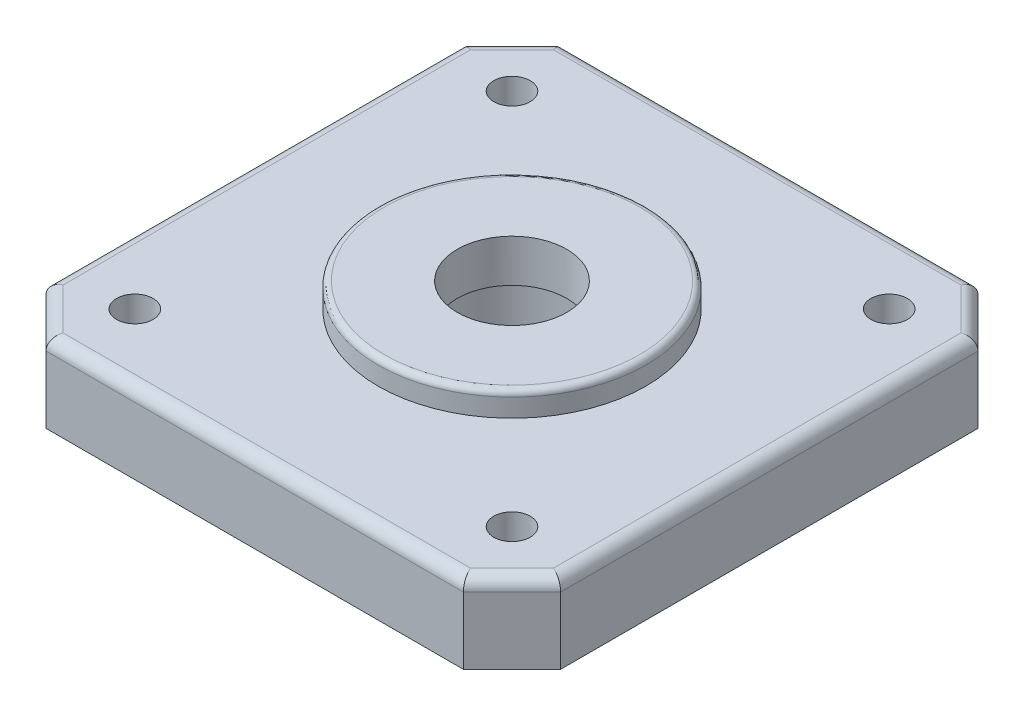
ISO-10303-21;
HEADER;
FILE_DESCRIPTION(('STEP AP214'),'2;1');
FILE_NAME('part.step','',(''),(''),'','','');
FILE_SCHEMA(('AUTOMOTIVE_DESIGN { 1 0 10303 214 1 1 1 1 }'));
ENDSEC;
DATA;
#1=APPLICATION_CONTEXT('core data for automotive mechanical design processes');
#2=APPLICATION_PROTOCOL_DEFINITION('international standard','automotive_design',2000,#1);
#3=PRODUCT_CONTEXT('',#1,'mechanical');
#4=PRODUCT('Part','Part','',(#3));
#5=PRODUCT_RELATED_PRODUCT_CATEGORY('part','',(#4));
#6=PRODUCT_DEFINITION_FORMATION('','',#4);
#7=PRODUCT_DEFINITION_CONTEXT('part definition',#1,'design');
#8=PRODUCT_DEFINITION('design','',#6,#7);
#9=PRODUCT_DEFINITION_SHAPE('','',#8);
#10=(LENGTH_UNIT() NAMED_UNIT(*) SI_UNIT(.MILLI.,.METRE.));
#11=(NAMED_UNIT(*) PLANE_ANGLE_UNIT() SI_UNIT($,.RADIAN.));
#12=(NAMED_UNIT(*) SI_UNIT($,.STERADIAN.) SOLID_ANGLE_UNIT());
#13=UNCERTAINTY_MEASURE_WITH_UNIT(LENGTH_MEASURE(1.E-05),#10,'distance_accuracy_value','');
#14=(GEOMETRIC_REPRESENTATION_CONTEXT(3) GLOBAL_UNCERTAINTY_ASSIGNED_CONTEXT((#13)) GLOBAL_UNIT_ASSIGNED_CONTEXT((#10,
#11,#12)) REPRESENTATION_CONTEXT('',''));
#15=CARTESIAN_POINT('',(0.,0.,0.));
#16=DIRECTION('',(0.,0.,1.));
#17=DIRECTION('',(1.,0.,0.));
#18=AXIS2_PLACEMENT_3D('',#15,#16,#17);
#19=CARTESIAN_POINT('',(0.,0.,0.));
#20=DIRECTION('',(0.,1.,0.));
#21=DIRECTION('',(0.,0.,1.));
#22=AXIS2_PLACEMENT_3D('',#19,#20,#21);
#23=CYLINDRICAL_SURFACE('',#22,4.5);
#24=CARTESIAN_POINT('',(0.,8.5,0.));
#25=DIRECTION('',(0.,1.,0.));
#26=DIRECTION('',(0.,0.,1.));
#27=AXIS2_PLACEMENT_3D('',#24,#25,#26);
#28=CIRCLE('',#27,4.5);
#29=CARTESIAN_POINT('',(0.,8.5,4.5));
#30=VERTEX_POINT('',#29);
#31=EDGE_CURVE('E186',#30,#30,#28,.T.);
#32=ORIENTED_EDGE('',*,*,#31,.T.);
#33=EDGE_LOOP('',(#32));
#34=FACE_BOUND('',#33,.T.);
#35=CARTESIAN_POINT('',(0.,5.,0.));
#36=DIRECTION('',(0.,-1.,0.));
#37=DIRECTION('',(0.,0.,-1.));
#38=AXIS2_PLACEMENT_3D('',#35,#36,#37);
#39=CIRCLE('',#38,4.5);
#40=CARTESIAN_POINT('',(0.,5.,-4.5));
#41=VERTEX_POINT('',#40);
#42=EDGE_CURVE('E183',#41,#41,#39,.F.);
#43=ORIENTED_EDGE('',*,*,#42,.F.);
#44=EDGE_LOOP('',(#43));
#45=FACE_BOUND('',#44,.T.);
#46=ADVANCED_FACE('F36',(#34,#45),#23,.F.);
#47=CARTESIAN_POINT('',(-17.15,6.5,-21.15));
#48=DIRECTION('',(0.,0.,1.));
#49=DIRECTION('',(1.,0.,0.));
#50=AXIS2_PLACEMENT_3D('',#47,#48,#49);
#51=PLANE('',#50);
#52=DIRECTION('',(0.,-1.,0.));
#53=VECTOR('',#52,1.);
#54=CARTESIAN_POINT('',(-17.15,6.5,-21.15));
#55=LINE('',#54,#53);
#56=CARTESIAN_POINT('',(-17.15,5.5,-21.15));
#57=VERTEX_POINT('',#56);
#58=CARTESIAN_POINT('',(-17.15,0.,-21.15));
#59=VERTEX_POINT('',#58);
#60=EDGE_CURVE('E124',#57,#59,#55,.T.);
#61=ORIENTED_EDGE('',*,*,#60,.F.);
#62=DIRECTION('',(-1.,0.,0.));
#63=VECTOR('',#62,1.);
#64=CARTESIAN_POINT('',(-17.15,5.5,-21.15));
#65=LINE('',#64,#63);
#66=CARTESIAN_POINT('',(17.15,5.5,-21.15));
#67=VERTEX_POINT('',#66);
#68=EDGE_CURVE('E218',#57,#67,#65,.F.);
#69=ORIENTED_EDGE('',*,*,#68,.T.);
#70=DIRECTION('',(0.,-1.,0.));
#71=VECTOR('',#70,1.);
#72=CARTESIAN_POINT('',(17.15,6.5,-21.15));
#73=LINE('',#72,#71);
#74=CARTESIAN_POINT('',(17.15,0.,-21.15));
#75=VERTEX_POINT('',#74);
#76=EDGE_CURVE('E146',#67,#75,#73,.T.);
#77=ORIENTED_EDGE('',*,*,#76,.T.);
#78=DIRECTION('',(-1.,0.,0.));
#79=VECTOR('',#78,1.);
#80=CARTESIAN_POINT('',(-17.15,0.,-21.15));
#81=LINE('',#80,#79);
#82=EDGE_CURVE('E139',#75,#59,#81,.T.);
#83=ORIENTED_EDGE('',*,*,#82,.T.);
#84=EDGE_LOOP('',(#61,#69,#77,#83));
#85=FACE_BOUND('',#84,.T.);
#86=ADVANCED_FACE('F144',(#85),#51,.F.);
#87=CARTESIAN_POINT('',(-21.15,6.5,-17.15));
#88=DIRECTION('',(0.707106781186548,0.,0.707106781186548));
#89=DIRECTION('',(0.707106781186548,0.,-0.707106781186548));
#90=AXIS2_PLACEMENT_3D('',#87,#88,#89);
#91=PLANE('',#90);
#92=DIRECTION('',(0.,-1.,0.));
#93=VECTOR('',#92,1.);
#94=CARTESIAN_POINT('',(-21.15,6.5,-17.15));
#95=LINE('',#94,#93);
#96=CARTESIAN_POINT('',(-21.15,5.5,-17.15));
#97=VERTEX_POINT('',#96);
#98=CARTESIAN_POINT('',(-21.15,0.,-17.15));
#99=VERTEX_POINT('',#98);
#100=EDGE_CURVE('E133',#97,#99,#95,.T.);
#101=ORIENTED_EDGE('',*,*,#100,.F.);
#102=DIRECTION('',(-0.707106781186548,0.,0.707106781186548));
#103=VECTOR('',#102,1.);
#104=CARTESIAN_POINT('',(-21.15,5.5,-17.15));
#105=LINE('',#104,#103);
#106=EDGE_CURVE('E51',#97,#57,#105,.F.);
#107=ORIENTED_EDGE('',*,*,#106,.T.);
#108=ORIENTED_EDGE('',*,*,#60,.T.);
#109=DIRECTION('',(-0.707106781186548,0.,0.707106781186548));
#110=VECTOR('',#109,1.);
#111=CARTESIAN_POINT('',(-21.15,0.,-17.15));
#112=LINE('',#111,#110);
#113=EDGE_CURVE('E127',#59,#99,#112,.T.);
#114=ORIENTED_EDGE('',*,*,#113,.T.);
#115=EDGE_LOOP('',(#101,#107,#108,#114));
#116=FACE_BOUND('',#115,.T.);
#117=ADVANCED_FACE('F126',(#116),#91,.F.);
#118=CARTESIAN_POINT('',(-21.15,6.5,-17.15));
#119=DIRECTION('',(1.,0.,0.));
#120=DIRECTION('',(0.,0.,-1.));
#121=AXIS2_PLACEMENT_3D('',#118,#119,#120);
#122=PLANE('',#121);
#123=DIRECTION('',(0.,-1.,0.));
#124=VECTOR('',#123,1.);
#125=CARTESIAN_POINT('',(-21.15,6.5,17.15));
#126=LINE('',#125,#124);
#127=CARTESIAN_POINT('',(-21.15,5.5,17.15));
#128=VERTEX_POINT('',#127);
#129=CARTESIAN_POINT('',(-21.15,0.,17.15));
#130=VERTEX_POINT('',#129);
#131=EDGE_CURVE('E180',#128,#130,#126,.T.);
#132=ORIENTED_EDGE('',*,*,#131,.F.);
#133=DIRECTION('',(0.,0.,1.));
#134=VECTOR('',#133,1.);
#135=CARTESIAN_POINT('',(-21.15,5.5,-17.15));
#136=LINE('',#135,#134);
#137=EDGE_CURVE('E59',#128,#97,#136,.F.);
#138=ORIENTED_EDGE('',*,*,#137,.T.);
#139=ORIENTED_EDGE('',*,*,#100,.T.);
#140=DIRECTION('',(0.,0.,1.));
#141=VECTOR('',#140,1.);
#142=CARTESIAN_POINT('',(-21.15,0.,-17.15));
#143=LINE('',#142,#141);
#144=EDGE_CURVE('E142',#99,#130,#143,.T.);
#145=ORIENTED_EDGE('',*,*,#144,.T.);
#146=EDGE_LOOP('',(#132,#138,#139,#145));
#147=FACE_BOUND('',#146,.T.);
#148=ADVANCED_FACE('F320',(#147),#122,.F.);
#149=CARTESIAN_POINT('',(-21.15,6.5,17.15));
#150=DIRECTION('',(0.707106781186548,0.,-0.707106781186548));
#151=DIRECTION('',(-0.707106781186548,0.,-0.707106781186548));
#152=AXIS2_PLACEMENT_3D('',#149,#150,#151);
#153=PLANE('',#152);
#154=DIRECTION('',(0.,-1.,0.));
#155=VECTOR('',#154,1.);
#156=CARTESIAN_POINT('',(-17.15,6.5,21.15));
#157=LINE('',#156,#155);
#158=CARTESIAN_POINT('',(-17.15,5.5,21.15));
#159=VERTEX_POINT('',#158);
#160=CARTESIAN_POINT('',(-17.15,0.,21.15));
#161=VERTEX_POINT('',#160);
#162=EDGE_CURVE('E178',#159,#161,#157,.T.);
#163=ORIENTED_EDGE('',*,*,#162,.F.);
#164=DIRECTION('',(0.707106781186548,0.,0.707106781186548));
#165=VECTOR('',#164,1.);
#166=CARTESIAN_POINT('',(-21.15,5.5,17.15));
#167=LINE('',#166,#165);
#168=EDGE_CURVE('E214',#159,#128,#167,.F.);
#169=ORIENTED_EDGE('',*,*,#168,.T.);
#170=ORIENTED_EDGE('',*,*,#131,.T.);
#171=DIRECTION('',(0.707106781186548,0.,0.707106781186548));
#172=VECTOR('',#171,1.);
#173=CARTESIAN_POINT('',(-21.15,0.,17.15));
#174=LINE('',#173,#172);
#175=EDGE_CURVE('E157',#130,#161,#174,.T.);
#176=ORIENTED_EDGE('',*,*,#175,.T.);
#177=EDGE_LOOP('',(#163,#169,#170,#176));
#178=FACE_BOUND('',#177,.T.);
#179=ADVANCED_FACE('F316',(#178),#153,.F.);
#180=CARTESIAN_POINT('',(-17.15,6.5,21.15));
#181=DIRECTION('',(0.,0.,-1.));
#182=DIRECTION('',(-1.,0.,0.));
#183=AXIS2_PLACEMENT_3D('',#180,#181,#182);
#184=PLANE('',#183);
#185=DIRECTION('',(0.,-1.,0.));
#186=VECTOR('',#185,1.);
#187=CARTESIAN_POINT('',(17.15,6.5,21.15));
#188=LINE('',#187,#186);
#189=CARTESIAN_POINT('',(17.15,5.5,21.15));
#190=VERTEX_POINT('',#189);
#191=CARTESIAN_POINT('',(17.15,0.,21.15));
#192=VERTEX_POINT('',#191);
#193=EDGE_CURVE('E176',#190,#192,#188,.T.);
#194=ORIENTED_EDGE('',*,*,#193,.F.);
#195=DIRECTION('',(1.,0.,0.));
#196=VECTOR('',#195,1.);
#197=CARTESIAN_POINT('',(-17.15,5.5,21.15));
#198=LINE('',#197,#196);
#199=EDGE_CURVE('E212',#190,#159,#198,.F.);
#200=ORIENTED_EDGE('',*,*,#199,.T.);
#201=ORIENTED_EDGE('',*,*,#162,.T.);
#202=DIRECTION('',(1.,0.,0.));
#203=VECTOR('',#202,1.);
#204=CARTESIAN_POINT('',(-17.15,0.,21.15));
#205=LINE('',#204,#203);
#206=EDGE_CURVE('E160',#161,#192,#205,.T.);
#207=ORIENTED_EDGE('',*,*,#206,.T.);
#208=EDGE_LOOP('',(#194,#200,#201,#207));
#209=FACE_BOUND('',#208,.T.);
#210=ADVANCED_FACE('F312',(#209),#184,.F.);
#211=CARTESIAN_POINT('',(17.15,6.5,21.15));
#212=DIRECTION('',(-0.707106781186548,0.,-0.707106781186548));
#213=DIRECTION('',(-0.707106781186548,0.,0.707106781186548));
#214=AXIS2_PLACEMENT_3D('',#211,#212,#213);
#215=PLANE('',#214);
#216=DIRECTION('',(0.,-1.,0.));
#217=VECTOR('',#216,1.);
#218=CARTESIAN_POINT('',(21.15,6.5,17.15));
#219=LINE('',#218,#217);
#220=CARTESIAN_POINT('',(21.15,5.5,17.15));
#221=VERTEX_POINT('',#220);
#222=CARTESIAN_POINT('',(21.15,0.,17.15));
#223=VERTEX_POINT('',#222);
#224=EDGE_CURVE('E174',#221,#223,#219,.T.);
#225=ORIENTED_EDGE('',*,*,#224,.F.);
#226=DIRECTION('',(0.707106781186548,0.,-0.707106781186548));
#227=VECTOR('',#226,1.);
#228=CARTESIAN_POINT('',(17.15,5.5,21.15));
#229=LINE('',#228,#227);
#230=EDGE_CURVE('E210',#221,#190,#229,.F.);
#231=ORIENTED_EDGE('',*,*,#230,.T.);
#232=ORIENTED_EDGE('',*,*,#193,.T.);
#233=DIRECTION('',(0.707106781186548,0.,-0.707106781186548));
#234=VECTOR('',#233,1.);
#235=CARTESIAN_POINT('',(17.15,0.,21.15));
#236=LINE('',#235,#234);
#237=EDGE_CURVE('E163',#192,#223,#236,.T.);
#238=ORIENTED_EDGE('',*,*,#237,.T.);
#239=EDGE_LOOP('',(#225,#231,#232,#238));
#240=FACE_BOUND('',#239,.T.);
#241=ADVANCED_FACE('F308',(#240),#215,.F.);
#242=CARTESIAN_POINT('',(21.15,6.5,-17.15));
#243=DIRECTION('',(-1.,0.,0.));
#244=DIRECTION('',(0.,0.,1.));
#245=AXIS2_PLACEMENT_3D('',#242,#243,#244);
#246=PLANE('',#245);
#247=DIRECTION('',(0.,-1.,0.));
#248=VECTOR('',#247,1.);
#249=CARTESIAN_POINT('',(21.15,6.5,-17.15));
#250=LINE('',#249,#248);
#251=CARTESIAN_POINT('',(21.15,5.5,-17.15));
#252=VERTEX_POINT('',#251);
#253=CARTESIAN_POINT('',(21.15,0.,-17.15));
#254=VERTEX_POINT('',#253);
#255=EDGE_CURVE('E172',#252,#254,#250,.T.);
#256=ORIENTED_EDGE('',*,*,#255,.F.);
#257=DIRECTION('',(0.,0.,-1.));
#258=VECTOR('',#257,1.);
#259=CARTESIAN_POINT('',(21.15,5.5,-17.15));
#260=LINE('',#259,#258);
#261=EDGE_CURVE('E208',#252,#221,#260,.F.);
#262=ORIENTED_EDGE('',*,*,#261,.T.);
#263=ORIENTED_EDGE('',*,*,#224,.T.);
#264=DIRECTION('',(0.,0.,-1.));
#265=VECTOR('',#264,1.);
#266=CARTESIAN_POINT('',(21.15,0.,-17.15));
#267=LINE('',#266,#265);
#268=EDGE_CURVE('E166',#223,#254,#267,.T.);
#269=ORIENTED_EDGE('',*,*,#268,.T.);
#270=EDGE_LOOP('',(#256,#262,#263,#269));
#271=FACE_BOUND('',#270,.T.);
#272=ADVANCED_FACE('F304',(#271),#246,.F.);
#273=CARTESIAN_POINT('',(17.15,6.5,-21.15));
#274=DIRECTION('',(-0.707106781186548,0.,0.707106781186548));
#275=DIRECTION('',(0.707106781186548,0.,0.707106781186548));
#276=AXIS2_PLACEMENT_3D('',#273,#274,#275);
#277=PLANE('',#276);
#278=ORIENTED_EDGE('',*,*,#76,.F.);
#279=DIRECTION('',(-0.707106781186548,0.,-0.707106781186548));
#280=VECTOR('',#279,1.);
#281=CARTESIAN_POINT('',(17.15,5.5,-21.15));
#282=LINE('',#281,#280);
#283=EDGE_CURVE('E205',#67,#252,#282,.F.);
#284=ORIENTED_EDGE('',*,*,#283,.T.);
#285=ORIENTED_EDGE('',*,*,#255,.T.);
#286=DIRECTION('',(-0.707106781186548,0.,-0.707106781186548));
#287=VECTOR('',#286,1.);
#288=CARTESIAN_POINT('',(17.15,0.,-21.15));
#289=LINE('',#288,#287);
#290=EDGE_CURVE('E169',#254,#75,#289,.T.);
#291=ORIENTED_EDGE('',*,*,#290,.T.);
#292=EDGE_LOOP('',(#278,#284,#285,#291));
#293=FACE_BOUND('',#292,.T.);
#294=ADVANCED_FACE('F297',(#293),#277,.F.);
#295=CARTESIAN_POINT('',(0.,6.5,0.));
#296=DIRECTION('',(0.,-1.,0.));
#297=DIRECTION('',(0.,0.,-1.));
#298=AXIS2_PLACEMENT_3D('',#295,#296,#297);
#299=PLANE('',#298);
#300=DIRECTION('',(0.,0.,-1.));
#301=VECTOR('',#300,1.);
#302=CARTESIAN_POINT('',(20.15,6.5,0.));
#303=LINE('',#302,#301);
#304=CARTESIAN_POINT('',(20.15,6.5,16.7357864376269));
#305=VERTEX_POINT('',#304);
#306=CARTESIAN_POINT('',(20.15,6.5,-16.7357864376269));
#307=VERTEX_POINT('',#306);
#308=EDGE_CURVE('E200',#305,#307,#303,.T.);
#309=ORIENTED_EDGE('',*,*,#308,.T.);
#310=DIRECTION('',(-0.707106781186548,0.,-0.707106781186548));
#311=VECTOR('',#310,1.);
#312=CARTESIAN_POINT('',(18.4428932188134,6.5,-18.4428932188134));
#313=LINE('',#312,#311);
#314=CARTESIAN_POINT('',(16.7357864376269,6.5,-20.15));
#315=VERTEX_POINT('',#314);
#316=EDGE_CURVE('E202',#307,#315,#313,.T.);
#317=ORIENTED_EDGE('',*,*,#316,.T.);
#318=DIRECTION('',(-1.,0.,0.));
#319=VECTOR('',#318,1.);
#320=CARTESIAN_POINT('',(0.,6.5,-20.15));
#321=LINE('',#320,#319);
#322=CARTESIAN_POINT('',(-16.7357864376269,6.5,-20.15));
#323=VERTEX_POINT('',#322);
#324=EDGE_CURVE('E188',#315,#323,#321,.T.);
#325=ORIENTED_EDGE('',*,*,#324,.T.);
#326=DIRECTION('',(-0.707106781186548,0.,0.707106781186548));
#327=VECTOR('',#326,1.);
#328=CARTESIAN_POINT('',(-18.4428932188135,6.5,-18.4428932188135));
#329=LINE('',#328,#327);
#330=CARTESIAN_POINT('',(-20.15,6.5,-16.7357864376269));
#331=VERTEX_POINT('',#330);
#332=EDGE_CURVE('E190',#323,#331,#329,.T.);
#333=ORIENTED_EDGE('',*,*,#332,.T.);
#334=DIRECTION('',(0.,0.,1.));
#335=VECTOR('',#334,1.);
#336=CARTESIAN_POINT('',(-20.15,6.5,0.));
#337=LINE('',#336,#335);
#338=CARTESIAN_POINT('',(-20.15,6.5,16.7357864376269));
#339=VERTEX_POINT('',#338);
#340=EDGE_CURVE('E192',#331,#339,#337,.T.);
#341=ORIENTED_EDGE('',*,*,#340,.T.);
#342=DIRECTION('',(0.707106781186548,0.,0.707106781186548));
#343=VECTOR('',#342,1.);
#344=CARTESIAN_POINT('',(-18.4428932188134,6.5,18.4428932188134));
#345=LINE('',#344,#343);
#346=CARTESIAN_POINT('',(-16.7357864376269,6.5,20.15));
#347=VERTEX_POINT('',#346);
#348=EDGE_CURVE('E194',#339,#347,#345,.T.);
#349=ORIENTED_EDGE('',*,*,#348,.T.);
#350=DIRECTION('',(1.,0.,0.));
#351=VECTOR('',#350,1.);
#352=CARTESIAN_POINT('',(0.,6.5,20.15));
#353=LINE('',#352,#351);
#354=CARTESIAN_POINT('',(16.7357864376269,6.5,20.15));
#355=VERTEX_POINT('',#354);
#356=EDGE_CURVE('E196',#347,#355,#353,.T.);
#357=ORIENTED_EDGE('',*,*,#356,.T.);
#358=DIRECTION('',(0.707106781186548,0.,-0.707106781186548));
#359=VECTOR('',#358,1.);
#360=CARTESIAN_POINT('',(18.4428932188134,6.5,18.4428932188134));
#361=LINE('',#360,#359);
#362=EDGE_CURVE('E198',#355,#305,#361,.T.);
#363=ORIENTED_EDGE('',*,*,#362,.T.);
#364=EDGE_LOOP('',(#309,#317,#325,#333,#341,#349,#357,#363));
#365=FACE_BOUND('',#364,.T.);
#366=CARTESIAN_POINT('',(15.5,6.5,-15.5));
#367=DIRECTION('',(0.,1.,0.));
#368=DIRECTION('',(0.,0.,1.));
#369=AXIS2_PLACEMENT_3D('',#366,#367,#368);
#370=CIRCLE('',#369,1.5);
#371=CARTESIAN_POINT('',(15.5,6.5,-14.));
#372=VERTEX_POINT('',#371);
#373=EDGE_CURVE('E387',#372,#372,#370,.T.);
#374=ORIENTED_EDGE('',*,*,#373,.F.);
#375=EDGE_LOOP('',(#374));
#376=FACE_BOUND('',#375,.T.);
#377=CARTESIAN_POINT('',(-15.5,6.5,15.5));
#378=DIRECTION('',(0.,1.,0.));
#379=DIRECTION('',(0.,0.,1.));
#380=AXIS2_PLACEMENT_3D('',#377,#378,#379);
#381=CIRCLE('',#380,1.5);
#382=CARTESIAN_POINT('',(-15.5,6.5,17.));
#383=VERTEX_POINT('',#382);
#384=EDGE_CURVE('E391',#383,#383,#381,.T.);
#385=ORIENTED_EDGE('',*,*,#384,.F.);
#386=EDGE_LOOP('',(#385));
#387=FACE_BOUND('',#386,.T.);
#388=CARTESIAN_POINT('',(15.5,6.5,15.5));
#389=DIRECTION('',(0.,1.,0.));
#390=DIRECTION('',(0.,0.,1.));
#391=AXIS2_PLACEMENT_3D('',#388,#389,#390);
#392=CIRCLE('',#391,1.5);
#393=CARTESIAN_POINT('',(15.5,6.5,17.));
#394=VERTEX_POINT('',#393);
#395=EDGE_CURVE('E395',#394,#394,#392,.T.);
#396=ORIENTED_EDGE('',*,*,#395,.F.);
#397=EDGE_LOOP('',(#396));
#398=FACE_BOUND('',#397,.T.);
#399=CARTESIAN_POINT('',(-15.5,6.5,-15.5));
#400=DIRECTION('',(0.,1.,0.));
#401=DIRECTION('',(0.,0.,1.));
#402=AXIS2_PLACEMENT_3D('',#399,#400,#401);
#403=CIRCLE('',#402,1.5);
#404=CARTESIAN_POINT('',(-15.5,6.5,-14.));
#405=VERTEX_POINT('',#404);
#406=EDGE_CURVE('E151',#405,#405,#403,.T.);
#407=ORIENTED_EDGE('',*,*,#406,.F.);
#408=EDGE_LOOP('',(#407));
#409=FACE_BOUND('',#408,.T.);
#410=CARTESIAN_POINT('',(0.,6.5,0.));
#411=DIRECTION('',(0.,1.,0.));
#412=DIRECTION('',(0.,0.,1.));
#413=AXIS2_PLACEMENT_3D('',#410,#411,#412);
#414=CIRCLE('',#413,11.);
#415=CARTESIAN_POINT('',(0.,6.5,11.));
#416=VERTEX_POINT('',#415);
#417=EDGE_CURVE('E132',#416,#416,#414,.T.);
#418=ORIENTED_EDGE('',*,*,#417,.F.);
#419=EDGE_LOOP('',(#418));
#420=FACE_BOUND('',#419,.T.);
#421=ADVANCED_FACE('F294',(#365,#376,#387,#398,#409,#420),#299,.F.);
#422=CARTESIAN_POINT('',(0.,0.,0.));
#423=DIRECTION('',(0.,-1.,0.));
#424=DIRECTION('',(0.,0.,-1.));
#425=AXIS2_PLACEMENT_3D('',#422,#423,#424);
#426=PLANE('',#425);
#427=CARTESIAN_POINT('',(0.,0.,0.));
#428=DIRECTION('',(0.,-1.,0.));
#429=DIRECTION('',(0.,0.,-1.));
#430=AXIS2_PLACEMENT_3D('',#427,#428,#429);
#431=CIRCLE('',#430,5.5);
#432=CARTESIAN_POINT('',(0.,0.,-5.5));
#433=VERTEX_POINT('',#432);
#434=EDGE_CURVE('E241',#433,#433,#431,.T.);
#435=ORIENTED_EDGE('',*,*,#434,.F.);
#436=EDGE_LOOP('',(#435));
#437=FACE_BOUND('',#436,.T.);
#438=CARTESIAN_POINT('',(15.5,0.,-15.5));
#439=DIRECTION('',(0.,1.,0.));
#440=DIRECTION('',(0.,0.,1.));
#441=AXIS2_PLACEMENT_3D('',#438,#439,#440);
#442=CIRCLE('',#441,1.5);
#443=CARTESIAN_POINT('',(15.5,0.,-14.));
#444=VERTEX_POINT('',#443);
#445=EDGE_CURVE('E403',#444,#444,#442,.T.);
#446=ORIENTED_EDGE('',*,*,#445,.T.);
#447=EDGE_LOOP('',(#446));
#448=FACE_BOUND('',#447,.T.);
#449=CARTESIAN_POINT('',(-15.5,0.,15.5));
#450=DIRECTION('',(0.,1.,0.));
#451=DIRECTION('',(0.,0.,1.));
#452=AXIS2_PLACEMENT_3D('',#449,#450,#451);
#453=CIRCLE('',#452,1.5);
#454=CARTESIAN_POINT('',(-15.5,0.,17.));
#455=VERTEX_POINT('',#454);
#456=EDGE_CURVE('E408',#455,#455,#453,.T.);
#457=ORIENTED_EDGE('',*,*,#456,.T.);
#458=EDGE_LOOP('',(#457));
#459=FACE_BOUND('',#458,.T.);
#460=CARTESIAN_POINT('',(15.5,0.,15.5));
#461=DIRECTION('',(0.,1.,0.));
#462=DIRECTION('',(0.,0.,1.));
#463=AXIS2_PLACEMENT_3D('',#460,#461,#462);
#464=CIRCLE('',#463,1.5);
#465=CARTESIAN_POINT('',(15.5,0.,17.));
#466=VERTEX_POINT('',#465);
#467=EDGE_CURVE('E409',#466,#466,#464,.T.);
#468=ORIENTED_EDGE('',*,*,#467,.T.);
#469=EDGE_LOOP('',(#468));
#470=FACE_BOUND('',#469,.T.);
#471=CARTESIAN_POINT('',(-15.5,0.,-15.5));
#472=DIRECTION('',(0.,1.,0.));
#473=DIRECTION('',(0.,0.,1.));
#474=AXIS2_PLACEMENT_3D('',#471,#472,#473);
#475=CIRCLE('',#474,1.5);
#476=CARTESIAN_POINT('',(-15.5,0.,-14.));
#477=VERTEX_POINT('',#476);
#478=EDGE_CURVE('E148',#477,#477,#475,.T.);
#479=ORIENTED_EDGE('',*,*,#478,.T.);
#480=EDGE_LOOP('',(#479));
#481=FACE_BOUND('',#480,.T.);
#482=ORIENTED_EDGE('',*,*,#82,.F.);
#483=ORIENTED_EDGE('',*,*,#290,.F.);
#484=ORIENTED_EDGE('',*,*,#268,.F.);
#485=ORIENTED_EDGE('',*,*,#237,.F.);
#486=ORIENTED_EDGE('',*,*,#206,.F.);
#487=ORIENTED_EDGE('',*,*,#175,.F.);
#488=ORIENTED_EDGE('',*,*,#144,.F.);
#489=ORIENTED_EDGE('',*,*,#113,.F.);
#490=EDGE_LOOP('',(#482,#483,#484,#485,#486,#487,#488,#489));
#491=FACE_BOUND('',#490,.T.);
#492=ADVANCED_FACE('F137',(#437,#448,#459,#470,#481,#491),#426,.T.);
#493=CARTESIAN_POINT('',(0.,8.5,0.));
#494=DIRECTION('',(0.,-1.,0.));
#495=DIRECTION('',(0.,0.,-1.));
#496=AXIS2_PLACEMENT_3D('',#493,#494,#495);
#497=CYLINDRICAL_SURFACE('',#496,11.);
#498=CARTESIAN_POINT('',(0.,8.,0.));
#499=DIRECTION('',(0.,1.,0.));
#500=DIRECTION('',(0.,0.,1.));
#501=AXIS2_PLACEMENT_3D('',#498,#499,#500);
#502=CIRCLE('',#501,11.);
#503=CARTESIAN_POINT('',(0.,8.,11.));
#504=VERTEX_POINT('',#503);
#505=EDGE_CURVE('E11',#504,#504,#502,.F.);
#506=ORIENTED_EDGE('',*,*,#505,.T.);
#507=EDGE_LOOP('',(#506));
#508=FACE_BOUND('',#507,.T.);
#509=ORIENTED_EDGE('',*,*,#417,.T.);
#510=EDGE_LOOP('',(#509));
#511=FACE_BOUND('',#510,.T.);
#512=ADVANCED_FACE('F290',(#508,#511),#497,.T.);
#513=CARTESIAN_POINT('',(0.,8.5,0.));
#514=DIRECTION('',(0.,1.,0.));
#515=DIRECTION('',(0.,0.,1.));
#516=AXIS2_PLACEMENT_3D('',#513,#514,#515);
#517=PLANE('',#516);
#518=CARTESIAN_POINT('',(0.,8.5,0.));
#519=DIRECTION('',(0.,1.,0.));
#520=DIRECTION('',(0.,0.,1.));
#521=AXIS2_PLACEMENT_3D('',#518,#519,#520);
#522=CIRCLE('',#521,10.5);
#523=CARTESIAN_POINT('',(0.,8.5,10.5));
#524=VERTEX_POINT('',#523);
#525=EDGE_CURVE('E44',#524,#524,#522,.T.);
#526=ORIENTED_EDGE('',*,*,#525,.T.);
#527=EDGE_LOOP('',(#526));
#528=FACE_BOUND('',#527,.T.);
#529=ORIENTED_EDGE('',*,*,#31,.F.);
#530=EDGE_LOOP('',(#529));
#531=FACE_BOUND('',#530,.T.);
#532=ADVANCED_FACE('F245',(#528,#531),#517,.T.);
#533=CARTESIAN_POINT('',(-15.5,0.,-15.5));
#534=DIRECTION('',(0.,1.,0.));
#535=DIRECTION('',(0.,0.,1.));
#536=AXIS2_PLACEMENT_3D('',#533,#534,#535);
#537=CYLINDRICAL_SURFACE('',#536,1.5);
#538=ORIENTED_EDGE('',*,*,#478,.F.);
#539=EDGE_LOOP('',(#538));
#540=FACE_BOUND('',#539,.T.);
#541=ORIENTED_EDGE('',*,*,#406,.T.);
#542=EDGE_LOOP('',(#541));
#543=FACE_BOUND('',#542,.T.);
#544=ADVANCED_FACE('F275',(#540,#543),#537,.F.);
#545=CARTESIAN_POINT('',(15.5,0.,15.5));
#546=DIRECTION('',(0.,1.,0.));
#547=DIRECTION('',(0.,0.,1.));
#548=AXIS2_PLACEMENT_3D('',#545,#546,#547);
#549=CYLINDRICAL_SURFACE('',#548,1.5);
#550=ORIENTED_EDGE('',*,*,#467,.F.);
#551=EDGE_LOOP('',(#550));
#552=FACE_BOUND('',#551,.T.);
#553=ORIENTED_EDGE('',*,*,#395,.T.);
#554=EDGE_LOOP('',(#553));
#555=FACE_BOUND('',#554,.T.);
#556=ADVANCED_FACE('F271',(#552,#555),#549,.F.);
#557=CARTESIAN_POINT('',(-15.5,0.,15.5));
#558=DIRECTION('',(0.,1.,0.));
#559=DIRECTION('',(0.,0.,1.));
#560=AXIS2_PLACEMENT_3D('',#557,#558,#559);
#561=CYLINDRICAL_SURFACE('',#560,1.5);
#562=ORIENTED_EDGE('',*,*,#456,.F.);
#563=EDGE_LOOP('',(#562));
#564=FACE_BOUND('',#563,.T.);
#565=ORIENTED_EDGE('',*,*,#384,.T.);
#566=EDGE_LOOP('',(#565));
#567=FACE_BOUND('',#566,.T.);
#568=ADVANCED_FACE('F274',(#564,#567),#561,.F.);
#569=CARTESIAN_POINT('',(15.5,0.,-15.5));
#570=DIRECTION('',(0.,1.,0.));
#571=DIRECTION('',(0.,0.,1.));
#572=AXIS2_PLACEMENT_3D('',#569,#570,#571);
#573=CYLINDRICAL_SURFACE('',#572,1.5);
#574=ORIENTED_EDGE('',*,*,#445,.F.);
#575=EDGE_LOOP('',(#574));
#576=FACE_BOUND('',#575,.T.);
#577=ORIENTED_EDGE('',*,*,#373,.T.);
#578=EDGE_LOOP('',(#577));
#579=FACE_BOUND('',#578,.T.);
#580=ADVANCED_FACE('F277',(#576,#579),#573,.F.);
#581=CARTESIAN_POINT('',(0.,5.,0.));
#582=DIRECTION('',(0.,-1.,0.));
#583=DIRECTION('',(0.,0.,-1.));
#584=AXIS2_PLACEMENT_3D('',#581,#582,#583);
#585=PLANE('',#584);
#586=CARTESIAN_POINT('',(0.,5.,0.));
#587=DIRECTION('',(0.,-1.,0.));
#588=DIRECTION('',(0.,0.,-1.));
#589=AXIS2_PLACEMENT_3D('',#586,#587,#588);
#590=CIRCLE('',#589,5.5);
#591=CARTESIAN_POINT('',(0.,5.,-5.5));
#592=VERTEX_POINT('',#591);
#593=EDGE_CURVE('E187',#592,#592,#590,.T.);
#594=ORIENTED_EDGE('',*,*,#593,.T.);
#595=EDGE_LOOP('',(#594));
#596=FACE_BOUND('',#595,.T.);
#597=ORIENTED_EDGE('',*,*,#42,.T.);
#598=EDGE_LOOP('',(#597));
#599=FACE_BOUND('',#598,.T.);
#600=ADVANCED_FACE('F280',(#596,#599),#585,.T.);
#601=CARTESIAN_POINT('',(0.,5.,0.));
#602=DIRECTION('',(0.,-1.,0.));
#603=DIRECTION('',(0.,0.,-1.));
#604=AXIS2_PLACEMENT_3D('',#601,#602,#603);
#605=CYLINDRICAL_SURFACE('',#604,5.5);
#606=ORIENTED_EDGE('',*,*,#593,.F.);
#607=EDGE_LOOP('',(#606));
#608=FACE_BOUND('',#607,.T.);
#609=ORIENTED_EDGE('',*,*,#434,.T.);
#610=EDGE_LOOP('',(#609));
#611=FACE_BOUND('',#610,.T.);
#612=ADVANCED_FACE('F269',(#608,#611),#605,.F.);
#613=CARTESIAN_POINT('',(-18.4428932188134,5.5,18.4428932188134));
#614=DIRECTION('',(0.707106781186548,0.,0.707106781186548));
#615=DIRECTION('',(0.707106781186548,0.,-0.707106781186548));
#616=AXIS2_PLACEMENT_3D('',#613,#614,#615);
#617=CYLINDRICAL_SURFACE('',#616,1.);
#618=CARTESIAN_POINT('',(-20.15,5.5,16.7357864376269));
#619=DIRECTION('',(0.38268343236509,0.,0.923879532511287));
#620=DIRECTION('',(-0.923879532511287,0.,0.38268343236509));
#621=AXIS2_PLACEMENT_3D('',#618,#619,#620);
#622=ELLIPSE('',#621,1.08239220029239,1.);
#623=EDGE_CURVE('E236',#128,#339,#622,.F.);
#624=ORIENTED_EDGE('',*,*,#623,.F.);
#625=ORIENTED_EDGE('',*,*,#168,.F.);
#626=CARTESIAN_POINT('',(-16.7357864376269,5.5,20.15));
#627=DIRECTION('',(0.923879532511287,0.,0.38268343236509));
#628=DIRECTION('',(-0.38268343236509,0.,0.923879532511287));
#629=AXIS2_PLACEMENT_3D('',#626,#627,#628);
#630=ELLIPSE('',#629,1.08239220029239,1.);
#631=EDGE_CURVE('E239',#347,#159,#630,.T.);
#632=ORIENTED_EDGE('',*,*,#631,.F.);
#633=ORIENTED_EDGE('',*,*,#348,.F.);
#634=EDGE_LOOP('',(#624,#625,#632,#633));
#635=FACE_BOUND('',#634,.T.);
#636=ADVANCED_FACE('F347',(#635),#617,.T.);
#637=CARTESIAN_POINT('',(0.,5.5,20.15));
#638=DIRECTION('',(1.,0.,0.));
#639=DIRECTION('',(0.,0.,-1.));
#640=AXIS2_PLACEMENT_3D('',#637,#638,#639);
#641=CYLINDRICAL_SURFACE('',#640,1.);
#642=ORIENTED_EDGE('',*,*,#631,.T.);
#643=ORIENTED_EDGE('',*,*,#199,.F.);
#644=CARTESIAN_POINT('',(16.7357864376269,5.5,20.15));
#645=DIRECTION('',(0.923879532511287,0.,-0.38268343236509));
#646=DIRECTION('',(0.38268343236509,0.,0.923879532511287));
#647=AXIS2_PLACEMENT_3D('',#644,#645,#646);
#648=ELLIPSE('',#647,1.08239220029239,1.);
#649=EDGE_CURVE('E233',#355,#190,#648,.T.);
#650=ORIENTED_EDGE('',*,*,#649,.F.);
#651=ORIENTED_EDGE('',*,*,#356,.F.);
#652=EDGE_LOOP('',(#642,#643,#650,#651));
#653=FACE_BOUND('',#652,.T.);
#654=ADVANCED_FACE('F344',(#653),#641,.T.);
#655=CARTESIAN_POINT('',(-20.15,5.5,0.));
#656=DIRECTION('',(0.,0.,1.));
#657=DIRECTION('',(1.,0.,0.));
#658=AXIS2_PLACEMENT_3D('',#655,#656,#657);
#659=CYLINDRICAL_SURFACE('',#658,1.);
#660=ORIENTED_EDGE('',*,*,#623,.T.);
#661=ORIENTED_EDGE('',*,*,#340,.F.);
#662=CARTESIAN_POINT('',(-20.15,5.5,-16.7357864376269));
#663=DIRECTION('',(-0.38268343236509,0.,0.923879532511287));
#664=DIRECTION('',(-0.923879532511287,0.,-0.38268343236509));
#665=AXIS2_PLACEMENT_3D('',#662,#663,#664);
#666=ELLIPSE('',#665,1.08239220029239,1.);
#667=EDGE_CURVE('E230',#97,#331,#666,.F.);
#668=ORIENTED_EDGE('',*,*,#667,.F.);
#669=ORIENTED_EDGE('',*,*,#137,.F.);
#670=EDGE_LOOP('',(#660,#661,#668,#669));
#671=FACE_BOUND('',#670,.T.);
#672=ADVANCED_FACE('F340',(#671),#659,.T.);
#673=CARTESIAN_POINT('',(18.4428932188134,5.5,18.4428932188134));
#674=DIRECTION('',(0.707106781186548,0.,-0.707106781186548));
#675=DIRECTION('',(-0.707106781186548,0.,-0.707106781186548));
#676=AXIS2_PLACEMENT_3D('',#673,#674,#675);
#677=CYLINDRICAL_SURFACE('',#676,1.);
#678=ORIENTED_EDGE('',*,*,#649,.T.);
#679=ORIENTED_EDGE('',*,*,#230,.F.);
#680=CARTESIAN_POINT('',(20.15,5.5,16.7357864376269));
#681=DIRECTION('',(0.38268343236509,0.,-0.923879532511287));
#682=DIRECTION('',(0.923879532511287,0.,0.38268343236509));
#683=AXIS2_PLACEMENT_3D('',#680,#681,#682);
#684=ELLIPSE('',#683,1.08239220029239,1.);
#685=EDGE_CURVE('E227',#305,#221,#684,.T.);
#686=ORIENTED_EDGE('',*,*,#685,.F.);
#687=ORIENTED_EDGE('',*,*,#362,.F.);
#688=EDGE_LOOP('',(#678,#679,#686,#687));
#689=FACE_BOUND('',#688,.T.);
#690=ADVANCED_FACE('F336',(#689),#677,.T.);
#691=CARTESIAN_POINT('',(-18.4428932188135,5.5,-18.4428932188135));
#692=DIRECTION('',(-0.707106781186548,0.,0.707106781186548));
#693=DIRECTION('',(0.707106781186548,0.,0.707106781186548));
#694=AXIS2_PLACEMENT_3D('',#691,#692,#693);
#695=CYLINDRICAL_SURFACE('',#694,1.);
#696=ORIENTED_EDGE('',*,*,#667,.T.);
#697=ORIENTED_EDGE('',*,*,#332,.F.);
#698=CARTESIAN_POINT('',(-16.7357864376269,5.5,-20.15));
#699=DIRECTION('',(-0.923879532511287,0.,0.38268343236509));
#700=DIRECTION('',(-0.38268343236509,0.,-0.923879532511287));
#701=AXIS2_PLACEMENT_3D('',#698,#699,#700);
#702=ELLIPSE('',#701,1.08239220029239,1.);
#703=EDGE_CURVE('E224',#57,#323,#702,.F.);
#704=ORIENTED_EDGE('',*,*,#703,.F.);
#705=ORIENTED_EDGE('',*,*,#106,.F.);
#706=EDGE_LOOP('',(#696,#697,#704,#705));
#707=FACE_BOUND('',#706,.T.);
#708=ADVANCED_FACE('F332',(#707),#695,.T.);
#709=CARTESIAN_POINT('',(20.15,5.5,0.));
#710=DIRECTION('',(0.,0.,-1.));
#711=DIRECTION('',(-1.,0.,0.));
#712=AXIS2_PLACEMENT_3D('',#709,#710,#711);
#713=CYLINDRICAL_SURFACE('',#712,1.);
#714=ORIENTED_EDGE('',*,*,#685,.T.);
#715=ORIENTED_EDGE('',*,*,#261,.F.);
#716=CARTESIAN_POINT('',(20.15,5.5,-16.7357864376269));
#717=DIRECTION('',(-0.38268343236509,0.,-0.923879532511287));
#718=DIRECTION('',(0.923879532511287,0.,-0.38268343236509));
#719=AXIS2_PLACEMENT_3D('',#716,#717,#718);
#720=ELLIPSE('',#719,1.08239220029239,1.);
#721=EDGE_CURVE('E222',#307,#252,#720,.T.);
#722=ORIENTED_EDGE('',*,*,#721,.F.);
#723=ORIENTED_EDGE('',*,*,#308,.F.);
#724=EDGE_LOOP('',(#714,#715,#722,#723));
#725=FACE_BOUND('',#724,.T.);
#726=ADVANCED_FACE('F328',(#725),#713,.T.);
#727=CARTESIAN_POINT('',(0.,5.5,-20.15));
#728=DIRECTION('',(-1.,0.,0.));
#729=DIRECTION('',(0.,0.,1.));
#730=AXIS2_PLACEMENT_3D('',#727,#728,#729);
#731=CYLINDRICAL_SURFACE('',#730,1.);
#732=ORIENTED_EDGE('',*,*,#703,.T.);
#733=ORIENTED_EDGE('',*,*,#324,.F.);
#734=CARTESIAN_POINT('',(16.7357864376269,5.5,-20.15));
#735=DIRECTION('',(-0.923879532511287,0.,-0.38268343236509));
#736=DIRECTION('',(-0.38268343236509,0.,0.923879532511287));
#737=AXIS2_PLACEMENT_3D('',#734,#735,#736);
#738=ELLIPSE('',#737,1.08239220029239,1.);
#739=EDGE_CURVE('E220',#67,#315,#738,.F.);
#740=ORIENTED_EDGE('',*,*,#739,.F.);
#741=ORIENTED_EDGE('',*,*,#68,.F.);
#742=EDGE_LOOP('',(#732,#733,#740,#741));
#743=FACE_BOUND('',#742,.T.);
#744=ADVANCED_FACE('F254',(#743),#731,.T.);
#745=CARTESIAN_POINT('',(18.4428932188134,5.5,-18.4428932188134));
#746=DIRECTION('',(-0.707106781186548,0.,-0.707106781186548));
#747=DIRECTION('',(-0.707106781186548,0.,0.707106781186548));
#748=AXIS2_PLACEMENT_3D('',#745,#746,#747);
#749=CYLINDRICAL_SURFACE('',#748,1.);
#750=ORIENTED_EDGE('',*,*,#721,.T.);
#751=ORIENTED_EDGE('',*,*,#283,.F.);
#752=ORIENTED_EDGE('',*,*,#739,.T.);
#753=ORIENTED_EDGE('',*,*,#316,.F.);
#754=EDGE_LOOP('',(#750,#751,#752,#753));
#755=FACE_BOUND('',#754,.T.);
#756=ADVANCED_FACE('F249',(#755),#749,.T.);
#757=CARTESIAN_POINT('',(0.,8.,0.));
#758=DIRECTION('',(0.,1.,0.));
#759=DIRECTION('',(0.,0.,1.));
#760=AXIS2_PLACEMENT_3D('',#757,#758,#759);
#761=TOROIDAL_SURFACE('',#760,10.5,0.5);
#762=ORIENTED_EDGE('',*,*,#505,.F.);
#763=EDGE_LOOP('',(#762));
#764=FACE_BOUND('',#763,.T.);
#765=ORIENTED_EDGE('',*,*,#525,.F.);
#766=EDGE_LOOP('',(#765));
#767=FACE_BOUND('',#766,.T.);
#768=ADVANCED_FACE('F38',(#764,#767),#761,.T.);
#769=CLOSED_SHELL('',(#46,#86,#117,#148,#179,#210,#241,#272,#294,#421,#492,#512,#532,#544,#556,
#568,#580,#600,#612,#636,#654,#672,#690,#708,#726,#744,#756,#768));
#770=MANIFOLD_SOLID_BREP('B2',#769);
#771=ADVANCED_BREP_SHAPE_REPRESENTATION('',(#18,#770),#14);
#772=SHAPE_DEFINITION_REPRESENTATION(#9,#771);
ENDSEC;
END-ISO-10303-21;
